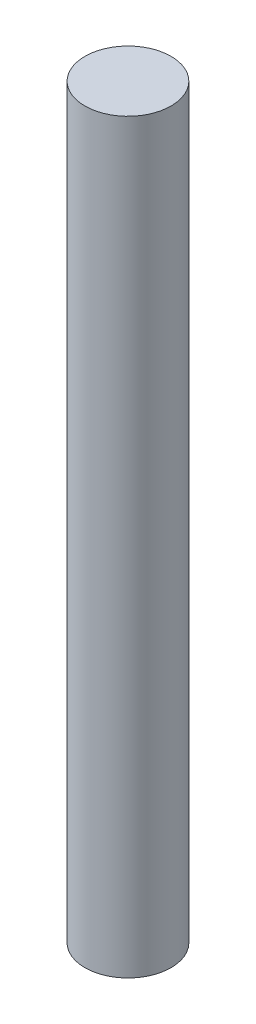
ISO-10303-21;
HEADER;
FILE_DESCRIPTION(('STEP AP214'),'2;1');
FILE_NAME('part.step','',(''),(''),'','','');
FILE_SCHEMA(('AUTOMOTIVE_DESIGN { 1 0 10303 214 1 1 1 1 }'));
ENDSEC;
DATA;
#1=APPLICATION_CONTEXT('core data for automotive mechanical design processes');
#2=APPLICATION_PROTOCOL_DEFINITION('international standard','automotive_design',2000,#1);
#3=PRODUCT_CONTEXT('',#1,'mechanical');
#4=PRODUCT('Part','Part','',(#3));
#5=PRODUCT_RELATED_PRODUCT_CATEGORY('part','',(#4));
#6=PRODUCT_DEFINITION_FORMATION('','',#4);
#7=PRODUCT_DEFINITION_CONTEXT('part definition',#1,'design');
#8=PRODUCT_DEFINITION('design','',#6,#7);
#9=PRODUCT_DEFINITION_SHAPE('','',#8);
#10=(LENGTH_UNIT() NAMED_UNIT(*) SI_UNIT(.MILLI.,.METRE.));
#11=(NAMED_UNIT(*) PLANE_ANGLE_UNIT() SI_UNIT($,.RADIAN.));
#12=(NAMED_UNIT(*) SI_UNIT($,.STERADIAN.) SOLID_ANGLE_UNIT());
#13=UNCERTAINTY_MEASURE_WITH_UNIT(LENGTH_MEASURE(1.E-05),#10,'distance_accuracy_value','');
#14=(GEOMETRIC_REPRESENTATION_CONTEXT(3) GLOBAL_UNCERTAINTY_ASSIGNED_CONTEXT((#13)) GLOBAL_UNIT_ASSIGNED_CONTEXT((#10,
#11,#12)) REPRESENTATION_CONTEXT('',''));
#15=CARTESIAN_POINT('',(0.,0.,0.));
#16=DIRECTION('',(0.,0.,1.));
#17=DIRECTION('',(1.,0.,0.));
#18=AXIS2_PLACEMENT_3D('',#15,#16,#17);
#19=CARTESIAN_POINT('',(0.,26.,0.));
#20=DIRECTION('',(0.,-1.,0.));
#21=DIRECTION('',(0.,0.,-1.));
#22=AXIS2_PLACEMENT_3D('',#19,#20,#21);
#23=CYLINDRICAL_SURFACE('',#22,1.5);
#24=CARTESIAN_POINT('',(0.,26.,0.));
#25=DIRECTION('',(0.,1.,0.));
#26=DIRECTION('',(0.,0.,1.));
#27=AXIS2_PLACEMENT_3D('',#24,#25,#26);
#28=CIRCLE('',#27,1.5);
#29=CARTESIAN_POINT('',(0.,26.,1.5));
#30=VERTEX_POINT('',#29);
#31=EDGE_CURVE('E10',#30,#30,#28,.T.);
#32=ORIENTED_EDGE('',*,*,#31,.F.);
#33=EDGE_LOOP('',(#32));
#34=FACE_BOUND('',#33,.T.);
#35=CARTESIAN_POINT('',(0.,0.,0.));
#36=DIRECTION('',(0.,1.,0.));
#37=DIRECTION('',(0.,0.,1.));
#38=AXIS2_PLACEMENT_3D('',#35,#36,#37);
#39=CIRCLE('',#38,1.5);
#40=CARTESIAN_POINT('',(0.,0.,1.5));
#41=VERTEX_POINT('',#40);
#42=EDGE_CURVE('E33',#41,#41,#39,.T.);
#43=ORIENTED_EDGE('',*,*,#42,.T.);
#44=EDGE_LOOP('',(#43));
#45=FACE_BOUND('',#44,.T.);
#46=ADVANCED_FACE('F30',(#34,#45),#23,.T.);
#47=CARTESIAN_POINT('',(0.,26.,0.));
#48=DIRECTION('',(0.,1.,0.));
#49=DIRECTION('',(0.,0.,1.));
#50=AXIS2_PLACEMENT_3D('',#47,#48,#49);
#51=PLANE('',#50);
#52=ORIENTED_EDGE('',*,*,#31,.T.);
#53=EDGE_LOOP('',(#52));
#54=FACE_BOUND('',#53,.T.);
#55=ADVANCED_FACE('F45',(#54),#51,.T.);
#56=CARTESIAN_POINT('',(0.,0.,0.));
#57=DIRECTION('',(0.,1.,0.));
#58=DIRECTION('',(0.,0.,1.));
#59=AXIS2_PLACEMENT_3D('',#56,#57,#58);
#60=PLANE('',#59);
#61=ORIENTED_EDGE('',*,*,#42,.F.);
#62=EDGE_LOOP('',(#61));
#63=FACE_BOUND('',#62,.T.);
#64=ADVANCED_FACE('F43',(#63),#60,.F.);
#65=CLOSED_SHELL('',(#46,#55,#64));
#66=MANIFOLD_SOLID_BREP('B2',#65);
#67=ADVANCED_BREP_SHAPE_REPRESENTATION('',(#18,#66),#14);
#68=SHAPE_DEFINITION_REPRESENTATION(#9,#67);
ENDSEC;
END-ISO-10303-21;
